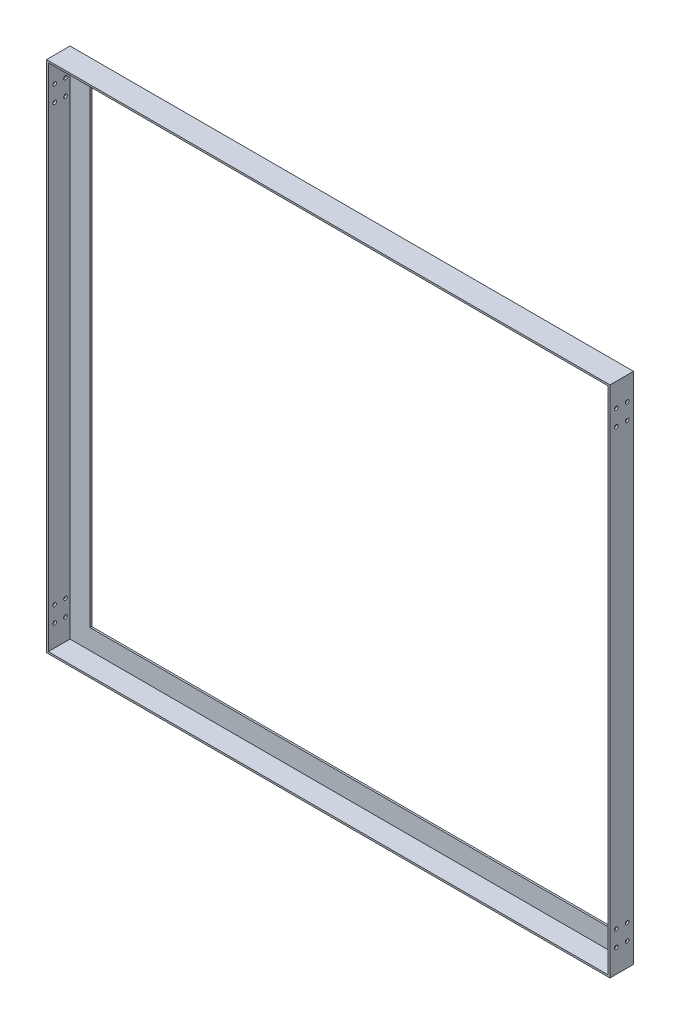
ISO-10303-21;
HEADER;
FILE_DESCRIPTION(('STEP AP214'),'2;1');
FILE_NAME('part.step','',(''),(''),'','','');
FILE_SCHEMA(('AUTOMOTIVE_DESIGN { 1 0 10303 214 1 1 1 1 }'));
ENDSEC;
DATA;
#1=APPLICATION_CONTEXT('core data for automotive mechanical design processes');
#2=APPLICATION_PROTOCOL_DEFINITION('international standard','automotive_design',2000,#1);
#3=PRODUCT_CONTEXT('',#1,'mechanical');
#4=PRODUCT('Part','Part','',(#3));
#5=PRODUCT_RELATED_PRODUCT_CATEGORY('part','',(#4));
#6=PRODUCT_DEFINITION_FORMATION('','',#4);
#7=PRODUCT_DEFINITION_CONTEXT('part definition',#1,'design');
#8=PRODUCT_DEFINITION('design','',#6,#7);
#9=PRODUCT_DEFINITION_SHAPE('','',#8);
#10=(LENGTH_UNIT() NAMED_UNIT(*) SI_UNIT(.MILLI.,.METRE.));
#11=(NAMED_UNIT(*) PLANE_ANGLE_UNIT() SI_UNIT($,.RADIAN.));
#12=(NAMED_UNIT(*) SI_UNIT($,.STERADIAN.) SOLID_ANGLE_UNIT());
#13=UNCERTAINTY_MEASURE_WITH_UNIT(LENGTH_MEASURE(1.E-05),#10,'distance_accuracy_value','');
#14=(GEOMETRIC_REPRESENTATION_CONTEXT(3) GLOBAL_UNCERTAINTY_ASSIGNED_CONTEXT((#13)) GLOBAL_UNIT_ASSIGNED_CONTEXT((#10,
#11,#12)) REPRESENTATION_CONTEXT('',''));
#15=CARTESIAN_POINT('',(0.,0.,0.));
#16=DIRECTION('',(0.,0.,1.));
#17=DIRECTION('',(1.,0.,0.));
#18=AXIS2_PLACEMENT_3D('',#15,#16,#17);
#19=CARTESIAN_POINT('',(0.,0.,3.1));
#20=DIRECTION('',(0.,0.,1.));
#21=DIRECTION('',(1.,0.,0.));
#22=AXIS2_PLACEMENT_3D('',#19,#20,#21);
#23=PLANE('',#22);
#24=DIRECTION('',(0.,-1.,0.));
#25=VECTOR('',#24,1.);
#26=CARTESIAN_POINT('',(-984.2,896.9,3.1));
#27=LINE('',#26,#25);
#28=CARTESIAN_POINT('',(-984.2,896.9,3.1));
#29=VERTEX_POINT('',#28);
#30=CARTESIAN_POINT('',(-984.2,3.1,3.1));
#31=VERTEX_POINT('',#30);
#32=EDGE_CURVE('E53',#29,#31,#27,.T.);
#33=ORIENTED_EDGE('',*,*,#32,.T.);
#34=DIRECTION('',(1.,0.,0.));
#35=VECTOR('',#34,1.);
#36=CARTESIAN_POINT('',(-984.2,3.1,3.1));
#37=LINE('',#36,#35);
#38=CARTESIAN_POINT('',(-3.09999999999988,3.1,3.1));
#39=VERTEX_POINT('',#38);
#40=EDGE_CURVE('E57',#31,#39,#37,.T.);
#41=ORIENTED_EDGE('',*,*,#40,.T.);
#42=DIRECTION('',(0.,1.,0.));
#43=VECTOR('',#42,1.);
#44=CARTESIAN_POINT('',(-3.09999999999999,896.9,3.1));
#45=LINE('',#44,#43);
#46=CARTESIAN_POINT('',(-3.09999999999999,896.9,3.1));
#47=VERTEX_POINT('',#46);
#48=EDGE_CURVE('E157',#39,#47,#45,.T.);
#49=ORIENTED_EDGE('',*,*,#48,.T.);
#50=DIRECTION('',(-1.,0.,0.));
#51=VECTOR('',#50,1.);
#52=CARTESIAN_POINT('',(-984.2,896.9,3.1));
#53=LINE('',#52,#51);
#54=EDGE_CURVE('E136',#47,#29,#53,.T.);
#55=ORIENTED_EDGE('',*,*,#54,.T.);
#56=EDGE_LOOP('',(#33,#41,#49,#55));
#57=FACE_BOUND('',#56,.T.);
#58=DIRECTION('',(-1.,0.,0.));
#59=VECTOR('',#58,1.);
#60=CARTESIAN_POINT('',(-38.1,861.9,3.1));
#61=LINE('',#60,#59);
#62=CARTESIAN_POINT('',(-38.1,861.9,3.1));
#63=VERTEX_POINT('',#62);
#64=CARTESIAN_POINT('',(-949.2,861.9,3.1));
#65=VERTEX_POINT('',#64);
#66=EDGE_CURVE('E179',#63,#65,#61,.T.);
#67=ORIENTED_EDGE('',*,*,#66,.F.);
#68=DIRECTION('',(0.,1.,0.));
#69=VECTOR('',#68,1.);
#70=CARTESIAN_POINT('',(-38.1,38.1,3.1));
#71=LINE('',#70,#69);
#72=CARTESIAN_POINT('',(-38.1,38.1,3.1));
#73=VERTEX_POINT('',#72);
#74=EDGE_CURVE('E177',#73,#63,#71,.T.);
#75=ORIENTED_EDGE('',*,*,#74,.F.);
#76=DIRECTION('',(1.,0.,0.));
#77=VECTOR('',#76,1.);
#78=CARTESIAN_POINT('',(-38.1,38.1,3.1));
#79=LINE('',#78,#77);
#80=CARTESIAN_POINT('',(-949.2,38.0999999999999,3.1));
#81=VERTEX_POINT('',#80);
#82=EDGE_CURVE('E185',#81,#73,#79,.T.);
#83=ORIENTED_EDGE('',*,*,#82,.F.);
#84=DIRECTION('',(0.,-1.,0.));
#85=VECTOR('',#84,1.);
#86=CARTESIAN_POINT('',(-949.2,38.0999999999999,3.1));
#87=LINE('',#86,#85);
#88=EDGE_CURVE('E182',#65,#81,#87,.T.);
#89=ORIENTED_EDGE('',*,*,#88,.F.);
#90=EDGE_LOOP('',(#67,#75,#83,#89));
#91=FACE_BOUND('',#90,.T.);
#92=ADVANCED_FACE('F36',(#57,#91),#23,.T.);
#93=CARTESIAN_POINT('',(0.,0.,0.));
#94=DIRECTION('',(0.,0.,1.));
#95=DIRECTION('',(1.,0.,0.));
#96=AXIS2_PLACEMENT_3D('',#93,#94,#95);
#97=PLANE('',#96);
#98=DIRECTION('',(0.,1.,0.));
#99=VECTOR('',#98,1.);
#100=CARTESIAN_POINT('',(0.,0.,0.));
#101=LINE('',#100,#99);
#102=CARTESIAN_POINT('',(0.,0.,0.));
#103=VERTEX_POINT('',#102);
#104=CARTESIAN_POINT('',(0.,900.,0.));
#105=VERTEX_POINT('',#104);
#106=EDGE_CURVE('E207',#103,#105,#101,.T.);
#107=ORIENTED_EDGE('',*,*,#106,.F.);
#108=DIRECTION('',(1.,0.,0.));
#109=VECTOR('',#108,1.);
#110=CARTESIAN_POINT('',(0.,0.,0.));
#111=LINE('',#110,#109);
#112=CARTESIAN_POINT('',(-987.3,-1.20909378479818E-13,0.));
#113=VERTEX_POINT('',#112);
#114=EDGE_CURVE('E214',#113,#103,#111,.T.);
#115=ORIENTED_EDGE('',*,*,#114,.F.);
#116=DIRECTION('',(0.,-1.,0.));
#117=VECTOR('',#116,1.);
#118=CARTESIAN_POINT('',(-987.3,-1.20909378479818E-13,0.));
#119=LINE('',#118,#117);
#120=CARTESIAN_POINT('',(-987.3,900.,0.));
#121=VERTEX_POINT('',#120);
#122=EDGE_CURVE('E212',#121,#113,#119,.T.);
#123=ORIENTED_EDGE('',*,*,#122,.F.);
#124=DIRECTION('',(-1.,0.,0.));
#125=VECTOR('',#124,1.);
#126=CARTESIAN_POINT('',(0.,900.,0.));
#127=LINE('',#126,#125);
#128=EDGE_CURVE('E210',#105,#121,#127,.T.);
#129=ORIENTED_EDGE('',*,*,#128,.F.);
#130=EDGE_LOOP('',(#107,#115,#123,#129));
#131=FACE_BOUND('',#130,.T.);
#132=DIRECTION('',(0.,1.,0.));
#133=VECTOR('',#132,1.);
#134=CARTESIAN_POINT('',(-38.1,38.1,0.));
#135=LINE('',#134,#133);
#136=CARTESIAN_POINT('',(-38.1,38.1,0.));
#137=VERTEX_POINT('',#136);
#138=CARTESIAN_POINT('',(-38.1,861.9,0.));
#139=VERTEX_POINT('',#138);
#140=EDGE_CURVE('E176',#137,#139,#135,.T.);
#141=ORIENTED_EDGE('',*,*,#140,.T.);
#142=DIRECTION('',(-1.,0.,0.));
#143=VECTOR('',#142,1.);
#144=CARTESIAN_POINT('',(-38.1,861.9,0.));
#145=LINE('',#144,#143);
#146=CARTESIAN_POINT('',(-949.2,861.9,0.));
#147=VERTEX_POINT('',#146);
#148=EDGE_CURVE('E190',#139,#147,#145,.T.);
#149=ORIENTED_EDGE('',*,*,#148,.T.);
#150=DIRECTION('',(0.,-1.,0.));
#151=VECTOR('',#150,1.);
#152=CARTESIAN_POINT('',(-949.2,38.0999999999999,0.));
#153=LINE('',#152,#151);
#154=CARTESIAN_POINT('',(-949.2,38.0999999999999,0.));
#155=VERTEX_POINT('',#154);
#156=EDGE_CURVE('E193',#147,#155,#153,.T.);
#157=ORIENTED_EDGE('',*,*,#156,.T.);
#158=DIRECTION('',(1.,0.,0.));
#159=VECTOR('',#158,1.);
#160=CARTESIAN_POINT('',(-38.1,38.1,0.));
#161=LINE('',#160,#159);
#162=EDGE_CURVE('E180',#155,#137,#161,.T.);
#163=ORIENTED_EDGE('',*,*,#162,.T.);
#164=EDGE_LOOP('',(#141,#149,#157,#163));
#165=FACE_BOUND('',#164,.T.);
#166=ADVANCED_FACE('F302',(#131,#165),#97,.F.);
#167=CARTESIAN_POINT('',(0.,0.,3.1));
#168=DIRECTION('',(-1.,0.,0.));
#169=DIRECTION('',(0.,0.,1.));
#170=AXIS2_PLACEMENT_3D('',#167,#168,#169);
#171=PLANE('',#170);
#172=CARTESIAN_POINT('',(0.,68.9999999999999,30.125));
#173=DIRECTION('',(-1.,0.,0.));
#174=DIRECTION('',(0.,0.,1.));
#175=AXIS2_PLACEMENT_3D('',#172,#173,#174);
#176=CIRCLE('',#175,3.17500000000004);
#177=CARTESIAN_POINT('',(0.,68.9999999999999,33.3));
#178=VERTEX_POINT('',#177);
#179=EDGE_CURVE('E155',#178,#178,#176,.T.);
#180=ORIENTED_EDGE('',*,*,#179,.T.);
#181=EDGE_LOOP('',(#180));
#182=FACE_BOUND('',#181,.T.);
#183=CARTESIAN_POINT('',(0.,831.,30.125));
#184=DIRECTION('',(-1.,0.,0.));
#185=DIRECTION('',(0.,0.,1.));
#186=AXIS2_PLACEMENT_3D('',#183,#184,#185);
#187=CIRCLE('',#186,3.175);
#188=CARTESIAN_POINT('',(0.,831.,33.3));
#189=VERTEX_POINT('',#188);
#190=EDGE_CURVE('E260',#189,#189,#187,.T.);
#191=ORIENTED_EDGE('',*,*,#190,.T.);
#192=EDGE_LOOP('',(#191));
#193=FACE_BOUND('',#192,.T.);
#194=CARTESIAN_POINT('',(0.,859.,30.125));
#195=DIRECTION('',(-1.,0.,0.));
#196=DIRECTION('',(0.,0.,1.));
#197=AXIS2_PLACEMENT_3D('',#194,#195,#196);
#198=CIRCLE('',#197,3.17500000000006);
#199=CARTESIAN_POINT('',(0.,859.,33.3000000000001));
#200=VERTEX_POINT('',#199);
#201=EDGE_CURVE('E256',#200,#200,#198,.T.);
#202=ORIENTED_EDGE('',*,*,#201,.T.);
#203=EDGE_LOOP('',(#202));
#204=FACE_BOUND('',#203,.T.);
#205=CARTESIAN_POINT('',(0.,831.,11.075));
#206=DIRECTION('',(-1.,0.,0.));
#207=DIRECTION('',(0.,0.,1.));
#208=AXIS2_PLACEMENT_3D('',#205,#206,#207);
#209=CIRCLE('',#208,3.175);
#210=CARTESIAN_POINT('',(0.,831.,14.25));
#211=VERTEX_POINT('',#210);
#212=EDGE_CURVE('E252',#211,#211,#209,.T.);
#213=ORIENTED_EDGE('',*,*,#212,.T.);
#214=EDGE_LOOP('',(#213));
#215=FACE_BOUND('',#214,.T.);
#216=CARTESIAN_POINT('',(0.,68.9999999999998,11.075));
#217=DIRECTION('',(-1.,0.,0.));
#218=DIRECTION('',(0.,0.,1.));
#219=AXIS2_PLACEMENT_3D('',#216,#217,#218);
#220=CIRCLE('',#219,3.17500000000002);
#221=CARTESIAN_POINT('',(0.,68.9999999999998,14.25));
#222=VERTEX_POINT('',#221);
#223=EDGE_CURVE('E248',#222,#222,#220,.T.);
#224=ORIENTED_EDGE('',*,*,#223,.T.);
#225=EDGE_LOOP('',(#224));
#226=FACE_BOUND('',#225,.T.);
#227=CARTESIAN_POINT('',(0.,40.9999999999998,11.075));
#228=DIRECTION('',(-1.,0.,0.));
#229=DIRECTION('',(0.,0.,1.));
#230=AXIS2_PLACEMENT_3D('',#227,#228,#229);
#231=CIRCLE('',#230,3.17500000000004);
#232=CARTESIAN_POINT('',(0.,40.9999999999998,14.25));
#233=VERTEX_POINT('',#232);
#234=EDGE_CURVE('E243',#233,#233,#231,.T.);
#235=ORIENTED_EDGE('',*,*,#234,.T.);
#236=EDGE_LOOP('',(#235));
#237=FACE_BOUND('',#236,.T.);
#238=CARTESIAN_POINT('',(0.,40.9999999999998,30.125));
#239=DIRECTION('',(-1.,0.,0.));
#240=DIRECTION('',(0.,0.,1.));
#241=AXIS2_PLACEMENT_3D('',#238,#239,#240);
#242=CIRCLE('',#241,3.17500000000007);
#243=CARTESIAN_POINT('',(0.,40.9999999999998,33.3000000000001));
#244=VERTEX_POINT('',#243);
#245=EDGE_CURVE('E238',#244,#244,#242,.T.);
#246=ORIENTED_EDGE('',*,*,#245,.T.);
#247=EDGE_LOOP('',(#246));
#248=FACE_BOUND('',#247,.T.);
#249=CARTESIAN_POINT('',(0.,859.,11.075));
#250=DIRECTION('',(-1.,0.,0.));
#251=DIRECTION('',(0.,0.,1.));
#252=AXIS2_PLACEMENT_3D('',#249,#250,#251);
#253=CIRCLE('',#252,3.17500000000007);
#254=CARTESIAN_POINT('',(0.,859.,14.2500000000001));
#255=VERTEX_POINT('',#254);
#256=EDGE_CURVE('E233',#255,#255,#253,.T.);
#257=ORIENTED_EDGE('',*,*,#256,.T.);
#258=EDGE_LOOP('',(#257));
#259=FACE_BOUND('',#258,.T.);
#260=ORIENTED_EDGE('',*,*,#106,.T.);
#261=DIRECTION('',(0.,0.,-1.));
#262=VECTOR('',#261,1.);
#263=CARTESIAN_POINT('',(0.,900.,3.1));
#264=LINE('',#263,#262);
#265=CARTESIAN_POINT('',(0.,900.,41.2));
#266=VERTEX_POINT('',#265);
#267=EDGE_CURVE('E11',#266,#105,#264,.T.);
#268=ORIENTED_EDGE('',*,*,#267,.F.);
#269=DIRECTION('',(0.,1.,0.));
#270=VECTOR('',#269,1.);
#271=CARTESIAN_POINT('',(0.,900.,41.2));
#272=LINE('',#271,#270);
#273=CARTESIAN_POINT('',(0.,0.,41.2));
#274=VERTEX_POINT('',#273);
#275=EDGE_CURVE('E170',#274,#266,#272,.T.);
#276=ORIENTED_EDGE('',*,*,#275,.F.);
#277=DIRECTION('',(0.,0.,-1.));
#278=VECTOR('',#277,1.);
#279=CARTESIAN_POINT('',(0.,0.,3.1));
#280=LINE('',#279,#278);
#281=EDGE_CURVE('E216',#274,#103,#280,.T.);
#282=ORIENTED_EDGE('',*,*,#281,.T.);
#283=EDGE_LOOP('',(#260,#268,#276,#282));
#284=FACE_BOUND('',#283,.T.);
#285=ADVANCED_FACE('F38',(#182,#193,#204,#215,#226,#237,#248,#259,#284),#171,.F.);
#286=CARTESIAN_POINT('',(0.,900.,3.1));
#287=DIRECTION('',(0.,-1.,0.));
#288=DIRECTION('',(1.,0.,0.));
#289=AXIS2_PLACEMENT_3D('',#286,#287,#288);
#290=PLANE('',#289);
#291=ORIENTED_EDGE('',*,*,#128,.T.);
#292=DIRECTION('',(0.,0.,-1.));
#293=VECTOR('',#292,1.);
#294=CARTESIAN_POINT('',(-987.3,900.,3.1));
#295=LINE('',#294,#293);
#296=CARTESIAN_POINT('',(-987.3,900.,41.2));
#297=VERTEX_POINT('',#296);
#298=EDGE_CURVE('E45',#297,#121,#295,.T.);
#299=ORIENTED_EDGE('',*,*,#298,.F.);
#300=DIRECTION('',(-1.,0.,0.));
#301=VECTOR('',#300,1.);
#302=CARTESIAN_POINT('',(-987.3,900.,41.2));
#303=LINE('',#302,#301);
#304=EDGE_CURVE('E173',#266,#297,#303,.T.);
#305=ORIENTED_EDGE('',*,*,#304,.F.);
#306=ORIENTED_EDGE('',*,*,#267,.T.);
#307=EDGE_LOOP('',(#291,#299,#305,#306));
#308=FACE_BOUND('',#307,.T.);
#309=ADVANCED_FACE('F320',(#308),#290,.F.);
#310=CARTESIAN_POINT('',(-987.3,-1.20909378479818E-13,3.1));
#311=DIRECTION('',(1.,0.,0.));
#312=DIRECTION('',(0.,0.,-1.));
#313=AXIS2_PLACEMENT_3D('',#310,#311,#312);
#314=PLANE('',#313);
#315=CARTESIAN_POINT('',(-987.3,68.9999999999999,30.125));
#316=DIRECTION('',(-1.,0.,0.));
#317=DIRECTION('',(0.,0.,1.));
#318=AXIS2_PLACEMENT_3D('',#315,#316,#317);
#319=CIRCLE('',#318,3.17500000000004);
#320=CARTESIAN_POINT('',(-987.3,68.9999999999999,33.3));
#321=VERTEX_POINT('',#320);
#322=EDGE_CURVE('E550',#321,#321,#319,.T.);
#323=ORIENTED_EDGE('',*,*,#322,.F.);
#324=EDGE_LOOP('',(#323));
#325=FACE_BOUND('',#324,.T.);
#326=CARTESIAN_POINT('',(-987.3,831.,30.125));
#327=DIRECTION('',(-1.,0.,0.));
#328=DIRECTION('',(0.,0.,-1.));
#329=AXIS2_PLACEMENT_3D('',#326,#327,#328);
#330=CIRCLE('',#329,3.175);
#331=CARTESIAN_POINT('',(-987.3,831.,26.95));
#332=VERTEX_POINT('',#331);
#333=EDGE_CURVE('E547',#332,#332,#330,.T.);
#334=ORIENTED_EDGE('',*,*,#333,.F.);
#335=EDGE_LOOP('',(#334));
#336=FACE_BOUND('',#335,.T.);
#337=CARTESIAN_POINT('',(-987.3,859.,30.125));
#338=DIRECTION('',(-1.,0.,0.));
#339=DIRECTION('',(0.,0.,-1.));
#340=AXIS2_PLACEMENT_3D('',#337,#338,#339);
#341=CIRCLE('',#340,3.17500000000006);
#342=CARTESIAN_POINT('',(-987.3,859.,26.9499999999999));
#343=VERTEX_POINT('',#342);
#344=EDGE_CURVE('E549',#343,#343,#341,.T.);
#345=ORIENTED_EDGE('',*,*,#344,.F.);
#346=EDGE_LOOP('',(#345));
#347=FACE_BOUND('',#346,.T.);
#348=CARTESIAN_POINT('',(-987.3,831.,11.075));
#349=DIRECTION('',(-1.,0.,0.));
#350=DIRECTION('',(0.,0.,1.));
#351=AXIS2_PLACEMENT_3D('',#348,#349,#350);
#352=CIRCLE('',#351,3.175);
#353=CARTESIAN_POINT('',(-987.3,831.,14.25));
#354=VERTEX_POINT('',#353);
#355=EDGE_CURVE('E553',#354,#354,#352,.T.);
#356=ORIENTED_EDGE('',*,*,#355,.F.);
#357=EDGE_LOOP('',(#356));
#358=FACE_BOUND('',#357,.T.);
#359=CARTESIAN_POINT('',(-987.3,68.9999999999998,11.075));
#360=DIRECTION('',(-1.,0.,0.));
#361=DIRECTION('',(0.,0.,-1.));
#362=AXIS2_PLACEMENT_3D('',#359,#360,#361);
#363=CIRCLE('',#362,3.17500000000002);
#364=CARTESIAN_POINT('',(-987.3,68.9999999999998,7.89999999999998));
#365=VERTEX_POINT('',#364);
#366=EDGE_CURVE('E556',#365,#365,#363,.T.);
#367=ORIENTED_EDGE('',*,*,#366,.F.);
#368=EDGE_LOOP('',(#367));
#369=FACE_BOUND('',#368,.T.);
#370=CARTESIAN_POINT('',(-987.3,40.9999999999998,11.075));
#371=DIRECTION('',(-1.,0.,0.));
#372=DIRECTION('',(0.,0.,-1.));
#373=AXIS2_PLACEMENT_3D('',#370,#371,#372);
#374=CIRCLE('',#373,3.17500000000004);
#375=CARTESIAN_POINT('',(-987.3,40.9999999999998,7.89999999999997));
#376=VERTEX_POINT('',#375);
#377=EDGE_CURVE('E617',#376,#376,#374,.T.);
#378=ORIENTED_EDGE('',*,*,#377,.F.);
#379=EDGE_LOOP('',(#378));
#380=FACE_BOUND('',#379,.T.);
#381=CARTESIAN_POINT('',(-987.3,40.9999999999998,30.125));
#382=DIRECTION('',(-1.,0.,0.));
#383=DIRECTION('',(0.,0.,1.));
#384=AXIS2_PLACEMENT_3D('',#381,#382,#383);
#385=CIRCLE('',#384,3.17500000000007);
#386=CARTESIAN_POINT('',(-987.3,40.9999999999998,33.3000000000001));
#387=VERTEX_POINT('',#386);
#388=EDGE_CURVE('E559',#387,#387,#385,.T.);
#389=ORIENTED_EDGE('',*,*,#388,.F.);
#390=EDGE_LOOP('',(#389));
#391=FACE_BOUND('',#390,.T.);
#392=CARTESIAN_POINT('',(-987.3,859.,11.075));
#393=DIRECTION('',(-1.,0.,0.));
#394=DIRECTION('',(0.,0.,1.));
#395=AXIS2_PLACEMENT_3D('',#392,#393,#394);
#396=CIRCLE('',#395,3.17500000000007);
#397=CARTESIAN_POINT('',(-987.3,859.,14.2500000000001));
#398=VERTEX_POINT('',#397);
#399=EDGE_CURVE('E228',#398,#398,#396,.T.);
#400=ORIENTED_EDGE('',*,*,#399,.F.);
#401=EDGE_LOOP('',(#400));
#402=FACE_BOUND('',#401,.T.);
#403=ORIENTED_EDGE('',*,*,#122,.T.);
#404=DIRECTION('',(0.,0.,-1.));
#405=VECTOR('',#404,1.);
#406=CARTESIAN_POINT('',(-987.3,-1.20909378479818E-13,3.1));
#407=LINE('',#406,#405);
#408=CARTESIAN_POINT('',(-987.3,0.,41.2));
#409=VERTEX_POINT('',#408);
#410=EDGE_CURVE('E219',#409,#113,#407,.T.);
#411=ORIENTED_EDGE('',*,*,#410,.F.);
#412=DIRECTION('',(0.,-1.,0.));
#413=VECTOR('',#412,1.);
#414=CARTESIAN_POINT('',(-987.3,900.,41.2));
#415=LINE('',#414,#413);
#416=EDGE_CURVE('E141',#297,#409,#415,.T.);
#417=ORIENTED_EDGE('',*,*,#416,.F.);
#418=ORIENTED_EDGE('',*,*,#298,.T.);
#419=EDGE_LOOP('',(#403,#411,#417,#418));
#420=FACE_BOUND('',#419,.T.);
#421=ADVANCED_FACE('F317',(#325,#336,#347,#358,#369,#380,#391,#402,#420),#314,.F.);
#422=CARTESIAN_POINT('',(0.,0.,3.1));
#423=DIRECTION('',(0.,1.,0.));
#424=DIRECTION('',(-1.,0.,0.));
#425=AXIS2_PLACEMENT_3D('',#422,#423,#424);
#426=PLANE('',#425);
#427=ORIENTED_EDGE('',*,*,#114,.T.);
#428=ORIENTED_EDGE('',*,*,#281,.F.);
#429=DIRECTION('',(1.,0.,0.));
#430=VECTOR('',#429,1.);
#431=CARTESIAN_POINT('',(-987.3,0.,41.2));
#432=LINE('',#431,#430);
#433=EDGE_CURVE('E167',#409,#274,#432,.T.);
#434=ORIENTED_EDGE('',*,*,#433,.F.);
#435=ORIENTED_EDGE('',*,*,#410,.T.);
#436=EDGE_LOOP('',(#427,#428,#434,#435));
#437=FACE_BOUND('',#436,.T.);
#438=ADVANCED_FACE('F314',(#437),#426,.F.);
#439=CARTESIAN_POINT('',(-38.1,38.1,3.1));
#440=DIRECTION('',(-1.,0.,0.));
#441=DIRECTION('',(0.,0.,1.));
#442=AXIS2_PLACEMENT_3D('',#439,#440,#441);
#443=PLANE('',#442);
#444=ORIENTED_EDGE('',*,*,#140,.F.);
#445=DIRECTION('',(0.,0.,-1.));
#446=VECTOR('',#445,1.);
#447=CARTESIAN_POINT('',(-38.1,38.1,3.1));
#448=LINE('',#447,#446);
#449=EDGE_CURVE('E187',#73,#137,#448,.T.);
#450=ORIENTED_EDGE('',*,*,#449,.F.);
#451=ORIENTED_EDGE('',*,*,#74,.T.);
#452=DIRECTION('',(0.,0.,-1.));
#453=VECTOR('',#452,1.);
#454=CARTESIAN_POINT('',(-38.1,861.9,3.1));
#455=LINE('',#454,#453);
#456=EDGE_CURVE('E204',#63,#139,#455,.T.);
#457=ORIENTED_EDGE('',*,*,#456,.T.);
#458=EDGE_LOOP('',(#444,#450,#451,#457));
#459=FACE_BOUND('',#458,.T.);
#460=ADVANCED_FACE('F311',(#459),#443,.T.);
#461=CARTESIAN_POINT('',(-38.1,861.9,3.1));
#462=DIRECTION('',(0.,-1.,0.));
#463=DIRECTION('',(1.,0.,0.));
#464=AXIS2_PLACEMENT_3D('',#461,#462,#463);
#465=PLANE('',#464);
#466=ORIENTED_EDGE('',*,*,#148,.F.);
#467=ORIENTED_EDGE('',*,*,#456,.F.);
#468=ORIENTED_EDGE('',*,*,#66,.T.);
#469=DIRECTION('',(0.,0.,-1.));
#470=VECTOR('',#469,1.);
#471=CARTESIAN_POINT('',(-949.2,861.9,3.1));
#472=LINE('',#471,#470);
#473=EDGE_CURVE('E202',#65,#147,#472,.T.);
#474=ORIENTED_EDGE('',*,*,#473,.T.);
#475=EDGE_LOOP('',(#466,#467,#468,#474));
#476=FACE_BOUND('',#475,.T.);
#477=ADVANCED_FACE('F353',(#476),#465,.T.);
#478=CARTESIAN_POINT('',(-949.2,38.0999999999999,3.1));
#479=DIRECTION('',(1.,0.,0.));
#480=DIRECTION('',(0.,0.,-1.));
#481=AXIS2_PLACEMENT_3D('',#478,#479,#480);
#482=PLANE('',#481);
#483=ORIENTED_EDGE('',*,*,#156,.F.);
#484=ORIENTED_EDGE('',*,*,#473,.F.);
#485=ORIENTED_EDGE('',*,*,#88,.T.);
#486=DIRECTION('',(0.,0.,-1.));
#487=VECTOR('',#486,1.);
#488=CARTESIAN_POINT('',(-949.2,38.0999999999999,3.1));
#489=LINE('',#488,#487);
#490=EDGE_CURVE('E200',#81,#155,#489,.T.);
#491=ORIENTED_EDGE('',*,*,#490,.T.);
#492=EDGE_LOOP('',(#483,#484,#485,#491));
#493=FACE_BOUND('',#492,.T.);
#494=ADVANCED_FACE('F347',(#493),#482,.T.);
#495=CARTESIAN_POINT('',(-38.1,38.1,3.1));
#496=DIRECTION('',(0.,1.,0.));
#497=DIRECTION('',(-1.,0.,0.));
#498=AXIS2_PLACEMENT_3D('',#495,#496,#497);
#499=PLANE('',#498);
#500=ORIENTED_EDGE('',*,*,#162,.F.);
#501=ORIENTED_EDGE('',*,*,#490,.F.);
#502=ORIENTED_EDGE('',*,*,#82,.T.);
#503=ORIENTED_EDGE('',*,*,#449,.T.);
#504=EDGE_LOOP('',(#500,#501,#502,#503));
#505=FACE_BOUND('',#504,.T.);
#506=ADVANCED_FACE('F339',(#505),#499,.T.);
#507=CARTESIAN_POINT('',(0.,0.,41.2));
#508=DIRECTION('',(0.,0.,1.));
#509=DIRECTION('',(1.,0.,0.));
#510=AXIS2_PLACEMENT_3D('',#507,#508,#509);
#511=PLANE('',#510);
#512=ORIENTED_EDGE('',*,*,#416,.T.);
#513=ORIENTED_EDGE('',*,*,#433,.T.);
#514=ORIENTED_EDGE('',*,*,#275,.T.);
#515=ORIENTED_EDGE('',*,*,#304,.T.);
#516=EDGE_LOOP('',(#512,#513,#514,#515));
#517=FACE_BOUND('',#516,.T.);
#518=DIRECTION('',(1.,0.,0.));
#519=VECTOR('',#518,1.);
#520=CARTESIAN_POINT('',(-984.2,3.1,41.2));
#521=LINE('',#520,#519);
#522=CARTESIAN_POINT('',(-984.2,3.1,41.2));
#523=VERTEX_POINT('',#522);
#524=CARTESIAN_POINT('',(-3.09999999999988,3.1,41.2));
#525=VERTEX_POINT('',#524);
#526=EDGE_CURVE('E135',#523,#525,#521,.T.);
#527=ORIENTED_EDGE('',*,*,#526,.F.);
#528=DIRECTION('',(0.,-1.,0.));
#529=VECTOR('',#528,1.);
#530=CARTESIAN_POINT('',(-984.2,896.9,41.2));
#531=LINE('',#530,#529);
#532=CARTESIAN_POINT('',(-984.2,896.9,41.2));
#533=VERTEX_POINT('',#532);
#534=EDGE_CURVE('E126',#533,#523,#531,.T.);
#535=ORIENTED_EDGE('',*,*,#534,.F.);
#536=DIRECTION('',(-1.,0.,0.));
#537=VECTOR('',#536,1.);
#538=CARTESIAN_POINT('',(-984.2,896.9,41.2));
#539=LINE('',#538,#537);
#540=CARTESIAN_POINT('',(-3.09999999999999,896.9,41.2));
#541=VERTEX_POINT('',#540);
#542=EDGE_CURVE('E149',#541,#533,#539,.T.);
#543=ORIENTED_EDGE('',*,*,#542,.F.);
#544=DIRECTION('',(0.,1.,0.));
#545=VECTOR('',#544,1.);
#546=CARTESIAN_POINT('',(-3.09999999999999,896.9,41.2));
#547=LINE('',#546,#545);
#548=EDGE_CURVE('E147',#525,#541,#547,.T.);
#549=ORIENTED_EDGE('',*,*,#548,.F.);
#550=EDGE_LOOP('',(#527,#535,#543,#549));
#551=FACE_BOUND('',#550,.T.);
#552=ADVANCED_FACE('F145',(#517,#551),#511,.T.);
#553=CARTESIAN_POINT('',(-984.2,896.9,41.2));
#554=DIRECTION('',(1.,0.,0.));
#555=DIRECTION('',(0.,1.,0.));
#556=AXIS2_PLACEMENT_3D('',#553,#554,#555);
#557=PLANE('',#556);
#558=CARTESIAN_POINT('',(-984.2,68.9999999999999,30.125));
#559=DIRECTION('',(1.,0.,0.));
#560=DIRECTION('',(0.,1.,0.));
#561=AXIS2_PLACEMENT_3D('',#558,#559,#560);
#562=CIRCLE('',#561,3.17500000000004);
#563=CARTESIAN_POINT('',(-984.2,72.1749999999999,30.125));
#564=VERTEX_POINT('',#563);
#565=EDGE_CURVE('E272',#564,#564,#562,.T.);
#566=ORIENTED_EDGE('',*,*,#565,.F.);
#567=EDGE_LOOP('',(#566));
#568=FACE_BOUND('',#567,.T.);
#569=CARTESIAN_POINT('',(-984.2,831.,30.125));
#570=DIRECTION('',(1.,0.,0.));
#571=DIRECTION('',(0.,1.,0.));
#572=AXIS2_PLACEMENT_3D('',#569,#570,#571);
#573=CIRCLE('',#572,3.175);
#574=CARTESIAN_POINT('',(-984.2,834.175,30.125));
#575=VERTEX_POINT('',#574);
#576=EDGE_CURVE('E255',#575,#575,#573,.T.);
#577=ORIENTED_EDGE('',*,*,#576,.F.);
#578=EDGE_LOOP('',(#577));
#579=FACE_BOUND('',#578,.T.);
#580=CARTESIAN_POINT('',(-984.2,859.,30.125));
#581=DIRECTION('',(1.,0.,0.));
#582=DIRECTION('',(0.,1.,0.));
#583=AXIS2_PLACEMENT_3D('',#580,#581,#582);
#584=CIRCLE('',#583,3.17500000000006);
#585=CARTESIAN_POINT('',(-984.2,862.175,30.125));
#586=VERTEX_POINT('',#585);
#587=EDGE_CURVE('E251',#586,#586,#584,.T.);
#588=ORIENTED_EDGE('',*,*,#587,.F.);
#589=EDGE_LOOP('',(#588));
#590=FACE_BOUND('',#589,.T.);
#591=CARTESIAN_POINT('',(-984.2,831.,11.075));
#592=DIRECTION('',(1.,0.,0.));
#593=DIRECTION('',(0.,1.,0.));
#594=AXIS2_PLACEMENT_3D('',#591,#592,#593);
#595=CIRCLE('',#594,3.175);
#596=CARTESIAN_POINT('',(-984.2,834.175,11.075));
#597=VERTEX_POINT('',#596);
#598=EDGE_CURVE('E247',#597,#597,#595,.T.);
#599=ORIENTED_EDGE('',*,*,#598,.F.);
#600=EDGE_LOOP('',(#599));
#601=FACE_BOUND('',#600,.T.);
#602=CARTESIAN_POINT('',(-984.2,68.9999999999998,11.075));
#603=DIRECTION('',(1.,0.,0.));
#604=DIRECTION('',(0.,1.,0.));
#605=AXIS2_PLACEMENT_3D('',#602,#603,#604);
#606=CIRCLE('',#605,3.17500000000002);
#607=CARTESIAN_POINT('',(-984.2,72.1749999999999,11.075));
#608=VERTEX_POINT('',#607);
#609=EDGE_CURVE('E242',#608,#608,#606,.T.);
#610=ORIENTED_EDGE('',*,*,#609,.F.);
#611=EDGE_LOOP('',(#610));
#612=FACE_BOUND('',#611,.T.);
#613=CARTESIAN_POINT('',(-984.2,40.9999999999998,11.075));
#614=DIRECTION('',(1.,0.,0.));
#615=DIRECTION('',(0.,1.,0.));
#616=AXIS2_PLACEMENT_3D('',#613,#614,#615);
#617=CIRCLE('',#616,3.17500000000004);
#618=CARTESIAN_POINT('',(-984.2,44.1749999999999,11.075));
#619=VERTEX_POINT('',#618);
#620=EDGE_CURVE('E237',#619,#619,#617,.T.);
#621=ORIENTED_EDGE('',*,*,#620,.F.);
#622=EDGE_LOOP('',(#621));
#623=FACE_BOUND('',#622,.T.);
#624=CARTESIAN_POINT('',(-984.2,40.9999999999998,30.125));
#625=DIRECTION('',(1.,0.,0.));
#626=DIRECTION('',(0.,1.,0.));
#627=AXIS2_PLACEMENT_3D('',#624,#625,#626);
#628=CIRCLE('',#627,3.17500000000007);
#629=CARTESIAN_POINT('',(-984.2,44.1749999999999,30.125));
#630=VERTEX_POINT('',#629);
#631=EDGE_CURVE('E232',#630,#630,#628,.T.);
#632=ORIENTED_EDGE('',*,*,#631,.F.);
#633=EDGE_LOOP('',(#632));
#634=FACE_BOUND('',#633,.T.);
#635=CARTESIAN_POINT('',(-984.2,859.,11.075));
#636=DIRECTION('',(1.,0.,0.));
#637=DIRECTION('',(0.,1.,0.));
#638=AXIS2_PLACEMENT_3D('',#635,#636,#637);
#639=CIRCLE('',#638,3.17500000000007);
#640=CARTESIAN_POINT('',(-984.2,862.175,11.075));
#641=VERTEX_POINT('',#640);
#642=EDGE_CURVE('E227',#641,#641,#639,.T.);
#643=ORIENTED_EDGE('',*,*,#642,.F.);
#644=EDGE_LOOP('',(#643));
#645=FACE_BOUND('',#644,.T.);
#646=ORIENTED_EDGE('',*,*,#32,.F.);
#647=DIRECTION('',(0.,0.,-1.));
#648=VECTOR('',#647,1.);
#649=CARTESIAN_POINT('',(-984.2,896.9,41.2));
#650=LINE('',#649,#648);
#651=EDGE_CURVE('E131',#533,#29,#650,.T.);
#652=ORIENTED_EDGE('',*,*,#651,.F.);
#653=ORIENTED_EDGE('',*,*,#534,.T.);
#654=DIRECTION('',(0.,0.,-1.));
#655=VECTOR('',#654,1.);
#656=CARTESIAN_POINT('',(-984.2,3.1,41.2));
#657=LINE('',#656,#655);
#658=EDGE_CURVE('E129',#523,#31,#657,.T.);
#659=ORIENTED_EDGE('',*,*,#658,.T.);
#660=EDGE_LOOP('',(#646,#652,#653,#659));
#661=FACE_BOUND('',#660,.T.);
#662=ADVANCED_FACE('F128',(#568,#579,#590,#601,#612,#623,#634,#645,#661),#557,.T.);
#663=CARTESIAN_POINT('',(-984.2,3.1,41.2));
#664=DIRECTION('',(0.,1.,0.));
#665=DIRECTION('',(0.,0.,1.));
#666=AXIS2_PLACEMENT_3D('',#663,#664,#665);
#667=PLANE('',#666);
#668=ORIENTED_EDGE('',*,*,#40,.F.);
#669=ORIENTED_EDGE('',*,*,#658,.F.);
#670=ORIENTED_EDGE('',*,*,#526,.T.);
#671=DIRECTION('',(0.,0.,-1.));
#672=VECTOR('',#671,1.);
#673=CARTESIAN_POINT('',(-3.09999999999988,3.1,41.2));
#674=LINE('',#673,#672);
#675=EDGE_CURVE('E142',#525,#39,#674,.T.);
#676=ORIENTED_EDGE('',*,*,#675,.T.);
#677=EDGE_LOOP('',(#668,#669,#670,#676));
#678=FACE_BOUND('',#677,.T.);
#679=ADVANCED_FACE('F139',(#678),#667,.T.);
#680=CARTESIAN_POINT('',(-3.09999999999999,896.9,41.2));
#681=DIRECTION('',(-1.,0.,0.));
#682=DIRECTION('',(0.,-1.,0.));
#683=AXIS2_PLACEMENT_3D('',#680,#681,#682);
#684=PLANE('',#683);
#685=CARTESIAN_POINT('',(-3.09999999999989,68.9999999999999,30.125));
#686=DIRECTION('',(-1.,0.,0.));
#687=DIRECTION('',(0.,-1.,0.));
#688=AXIS2_PLACEMENT_3D('',#685,#686,#687);
#689=CIRCLE('',#688,3.17500000000004);
#690=CARTESIAN_POINT('',(-3.09999999999989,65.8249999999999,30.125));
#691=VERTEX_POINT('',#690);
#692=EDGE_CURVE('E40',#691,#691,#689,.T.);
#693=ORIENTED_EDGE('',*,*,#692,.F.);
#694=EDGE_LOOP('',(#693));
#695=FACE_BOUND('',#694,.T.);
#696=CARTESIAN_POINT('',(-3.09999999999999,831.,30.125));
#697=DIRECTION('',(-1.,0.,0.));
#698=DIRECTION('',(0.,-1.,0.));
#699=AXIS2_PLACEMENT_3D('',#696,#697,#698);
#700=CIRCLE('',#699,3.175);
#701=CARTESIAN_POINT('',(-3.09999999999999,827.825,30.125));
#702=VERTEX_POINT('',#701);
#703=EDGE_CURVE('E253',#702,#702,#700,.T.);
#704=ORIENTED_EDGE('',*,*,#703,.F.);
#705=EDGE_LOOP('',(#704));
#706=FACE_BOUND('',#705,.T.);
#707=CARTESIAN_POINT('',(-3.09999999999999,859.,30.125));
#708=DIRECTION('',(-1.,0.,0.));
#709=DIRECTION('',(0.,-1.,0.));
#710=AXIS2_PLACEMENT_3D('',#707,#708,#709);
#711=CIRCLE('',#710,3.17500000000006);
#712=CARTESIAN_POINT('',(-3.09999999999999,855.825,30.125));
#713=VERTEX_POINT('',#712);
#714=EDGE_CURVE('E249',#713,#713,#711,.T.);
#715=ORIENTED_EDGE('',*,*,#714,.F.);
#716=EDGE_LOOP('',(#715));
#717=FACE_BOUND('',#716,.T.);
#718=CARTESIAN_POINT('',(-3.09999999999999,831.,11.075));
#719=DIRECTION('',(-1.,0.,0.));
#720=DIRECTION('',(0.,-1.,0.));
#721=AXIS2_PLACEMENT_3D('',#718,#719,#720);
#722=CIRCLE('',#721,3.175);
#723=CARTESIAN_POINT('',(-3.09999999999999,827.825,11.075));
#724=VERTEX_POINT('',#723);
#725=EDGE_CURVE('E244',#724,#724,#722,.T.);
#726=ORIENTED_EDGE('',*,*,#725,.F.);
#727=EDGE_LOOP('',(#726));
#728=FACE_BOUND('',#727,.T.);
#729=CARTESIAN_POINT('',(-3.09999999999989,68.9999999999998,11.075));
#730=DIRECTION('',(-1.,0.,0.));
#731=DIRECTION('',(0.,-1.,0.));
#732=AXIS2_PLACEMENT_3D('',#729,#730,#731);
#733=CIRCLE('',#732,3.17500000000002);
#734=CARTESIAN_POINT('',(-3.09999999999989,65.8249999999998,11.075));
#735=VERTEX_POINT('',#734);
#736=EDGE_CURVE('E239',#735,#735,#733,.T.);
#737=ORIENTED_EDGE('',*,*,#736,.F.);
#738=EDGE_LOOP('',(#737));
#739=FACE_BOUND('',#738,.T.);
#740=CARTESIAN_POINT('',(-3.09999999999989,40.9999999999998,11.075));
#741=DIRECTION('',(-1.,0.,0.));
#742=DIRECTION('',(0.,-1.,0.));
#743=AXIS2_PLACEMENT_3D('',#740,#741,#742);
#744=CIRCLE('',#743,3.17500000000004);
#745=CARTESIAN_POINT('',(-3.09999999999989,37.8249999999998,11.075));
#746=VERTEX_POINT('',#745);
#747=EDGE_CURVE('E234',#746,#746,#744,.T.);
#748=ORIENTED_EDGE('',*,*,#747,.F.);
#749=EDGE_LOOP('',(#748));
#750=FACE_BOUND('',#749,.T.);
#751=CARTESIAN_POINT('',(-3.09999999999989,40.9999999999998,30.125));
#752=DIRECTION('',(-1.,0.,0.));
#753=DIRECTION('',(0.,-1.,0.));
#754=AXIS2_PLACEMENT_3D('',#751,#752,#753);
#755=CIRCLE('',#754,3.17500000000007);
#756=CARTESIAN_POINT('',(-3.09999999999989,37.8249999999997,30.125));
#757=VERTEX_POINT('',#756);
#758=EDGE_CURVE('E229',#757,#757,#755,.T.);
#759=ORIENTED_EDGE('',*,*,#758,.F.);
#760=EDGE_LOOP('',(#759));
#761=FACE_BOUND('',#760,.T.);
#762=CARTESIAN_POINT('',(-3.09999999999999,859.,11.075));
#763=DIRECTION('',(-1.,0.,0.));
#764=DIRECTION('',(0.,-1.,0.));
#765=AXIS2_PLACEMENT_3D('',#762,#763,#764);
#766=CIRCLE('',#765,3.17500000000007);
#767=CARTESIAN_POINT('',(-3.09999999999999,855.825,11.075));
#768=VERTEX_POINT('',#767);
#769=EDGE_CURVE('E224',#768,#768,#766,.T.);
#770=ORIENTED_EDGE('',*,*,#769,.F.);
#771=EDGE_LOOP('',(#770));
#772=FACE_BOUND('',#771,.T.);
#773=ORIENTED_EDGE('',*,*,#48,.F.);
#774=ORIENTED_EDGE('',*,*,#675,.F.);
#775=ORIENTED_EDGE('',*,*,#548,.T.);
#776=DIRECTION('',(0.,0.,-1.));
#777=VECTOR('',#776,1.);
#778=CARTESIAN_POINT('',(-3.09999999999999,896.9,41.2));
#779=LINE('',#778,#777);
#780=EDGE_CURVE('E161',#541,#47,#779,.T.);
#781=ORIENTED_EDGE('',*,*,#780,.T.);
#782=EDGE_LOOP('',(#773,#774,#775,#781));
#783=FACE_BOUND('',#782,.T.);
#784=ADVANCED_FACE('F401',(#695,#706,#717,#728,#739,#750,#761,#772,#783),#684,.T.);
#785=CARTESIAN_POINT('',(-984.2,896.9,41.2));
#786=DIRECTION('',(0.,-1.,0.));
#787=DIRECTION('',(0.,0.,-1.));
#788=AXIS2_PLACEMENT_3D('',#785,#786,#787);
#789=PLANE('',#788);
#790=ORIENTED_EDGE('',*,*,#54,.F.);
#791=ORIENTED_EDGE('',*,*,#780,.F.);
#792=ORIENTED_EDGE('',*,*,#542,.T.);
#793=ORIENTED_EDGE('',*,*,#651,.T.);
#794=EDGE_LOOP('',(#790,#791,#792,#793));
#795=FACE_BOUND('',#794,.T.);
#796=ADVANCED_FACE('F406',(#795),#789,.T.);
#797=CARTESIAN_POINT('',(12.6999999999999,859.,11.075));
#798=DIRECTION('',(-1.,0.,0.));
#799=DIRECTION('',(0.,0.,1.));
#800=AXIS2_PLACEMENT_3D('',#797,#798,#799);
#801=CYLINDRICAL_SURFACE('',#800,3.17500000000007);
#802=ORIENTED_EDGE('',*,*,#769,.T.);
#803=EDGE_LOOP('',(#802));
#804=FACE_BOUND('',#803,.T.);
#805=ORIENTED_EDGE('',*,*,#256,.F.);
#806=EDGE_LOOP('',(#805));
#807=FACE_BOUND('',#806,.T.);
#808=ADVANCED_FACE('F293',(#804,#807),#801,.F.);
#809=CARTESIAN_POINT('',(12.6999999999999,40.9999999999998,30.125));
#810=DIRECTION('',(-1.,0.,0.));
#811=DIRECTION('',(0.,0.,1.));
#812=AXIS2_PLACEMENT_3D('',#809,#810,#811);
#813=CYLINDRICAL_SURFACE('',#812,3.17500000000007);
#814=ORIENTED_EDGE('',*,*,#758,.T.);
#815=EDGE_LOOP('',(#814));
#816=FACE_BOUND('',#815,.T.);
#817=ORIENTED_EDGE('',*,*,#245,.F.);
#818=EDGE_LOOP('',(#817));
#819=FACE_BOUND('',#818,.T.);
#820=ADVANCED_FACE('F418',(#816,#819),#813,.F.);
#821=CARTESIAN_POINT('',(12.6999999999999,40.9999999999998,11.075));
#822=DIRECTION('',(-1.,0.,0.));
#823=DIRECTION('',(0.,0.,1.));
#824=AXIS2_PLACEMENT_3D('',#821,#822,#823);
#825=CYLINDRICAL_SURFACE('',#824,3.17500000000004);
#826=ORIENTED_EDGE('',*,*,#747,.T.);
#827=EDGE_LOOP('',(#826));
#828=FACE_BOUND('',#827,.T.);
#829=ORIENTED_EDGE('',*,*,#234,.F.);
#830=EDGE_LOOP('',(#829));
#831=FACE_BOUND('',#830,.T.);
#832=ADVANCED_FACE('F427',(#828,#831),#825,.F.);
#833=CARTESIAN_POINT('',(12.6999999999999,68.9999999999998,11.075));
#834=DIRECTION('',(-1.,0.,0.));
#835=DIRECTION('',(0.,0.,1.));
#836=AXIS2_PLACEMENT_3D('',#833,#834,#835);
#837=CYLINDRICAL_SURFACE('',#836,3.17500000000002);
#838=ORIENTED_EDGE('',*,*,#736,.T.);
#839=EDGE_LOOP('',(#838));
#840=FACE_BOUND('',#839,.T.);
#841=ORIENTED_EDGE('',*,*,#223,.F.);
#842=EDGE_LOOP('',(#841));
#843=FACE_BOUND('',#842,.T.);
#844=ADVANCED_FACE('F437',(#840,#843),#837,.F.);
#845=CARTESIAN_POINT('',(12.6999999999999,831.,11.075));
#846=DIRECTION('',(-1.,0.,0.));
#847=DIRECTION('',(0.,0.,1.));
#848=AXIS2_PLACEMENT_3D('',#845,#846,#847);
#849=CYLINDRICAL_SURFACE('',#848,3.175);
#850=ORIENTED_EDGE('',*,*,#725,.T.);
#851=EDGE_LOOP('',(#850));
#852=FACE_BOUND('',#851,.T.);
#853=ORIENTED_EDGE('',*,*,#212,.F.);
#854=EDGE_LOOP('',(#853));
#855=FACE_BOUND('',#854,.T.);
#856=ADVANCED_FACE('F448',(#852,#855),#849,.F.);
#857=CARTESIAN_POINT('',(12.6999999999999,859.,30.125));
#858=DIRECTION('',(-1.,0.,0.));
#859=DIRECTION('',(0.,0.,1.));
#860=AXIS2_PLACEMENT_3D('',#857,#858,#859);
#861=CYLINDRICAL_SURFACE('',#860,3.17500000000006);
#862=ORIENTED_EDGE('',*,*,#714,.T.);
#863=EDGE_LOOP('',(#862));
#864=FACE_BOUND('',#863,.T.);
#865=ORIENTED_EDGE('',*,*,#201,.F.);
#866=EDGE_LOOP('',(#865));
#867=FACE_BOUND('',#866,.T.);
#868=ADVANCED_FACE('F294',(#864,#867),#861,.F.);
#869=CARTESIAN_POINT('',(12.6999999999999,831.,30.125));
#870=DIRECTION('',(-1.,0.,0.));
#871=DIRECTION('',(0.,0.,1.));
#872=AXIS2_PLACEMENT_3D('',#869,#870,#871);
#873=CYLINDRICAL_SURFACE('',#872,3.175);
#874=ORIENTED_EDGE('',*,*,#703,.T.);
#875=EDGE_LOOP('',(#874));
#876=FACE_BOUND('',#875,.T.);
#877=ORIENTED_EDGE('',*,*,#190,.F.);
#878=EDGE_LOOP('',(#877));
#879=FACE_BOUND('',#878,.T.);
#880=ADVANCED_FACE('F282',(#876,#879),#873,.F.);
#881=CARTESIAN_POINT('',(12.6999999999999,68.9999999999999,30.125));
#882=DIRECTION('',(-1.,0.,0.));
#883=DIRECTION('',(0.,0.,1.));
#884=AXIS2_PLACEMENT_3D('',#881,#882,#883);
#885=CYLINDRICAL_SURFACE('',#884,3.17500000000004);
#886=ORIENTED_EDGE('',*,*,#692,.T.);
#887=EDGE_LOOP('',(#886));
#888=FACE_BOUND('',#887,.T.);
#889=ORIENTED_EDGE('',*,*,#179,.F.);
#890=EDGE_LOOP('',(#889));
#891=FACE_BOUND('',#890,.T.);
#892=ADVANCED_FACE('F279',(#888,#891),#885,.F.);
#893=ORIENTED_EDGE('',*,*,#642,.T.);
#894=EDGE_LOOP('',(#893));
#895=FACE_BOUND('',#894,.T.);
#896=ORIENTED_EDGE('',*,*,#399,.T.);
#897=EDGE_LOOP('',(#896));
#898=FACE_BOUND('',#897,.T.);
#899=ADVANCED_FACE('F281',(#895,#898),#801,.F.);
#900=ORIENTED_EDGE('',*,*,#631,.T.);
#901=EDGE_LOOP('',(#900));
#902=FACE_BOUND('',#901,.T.);
#903=ORIENTED_EDGE('',*,*,#388,.T.);
#904=EDGE_LOOP('',(#903));
#905=FACE_BOUND('',#904,.T.);
#906=ADVANCED_FACE('F290',(#902,#905),#813,.F.);
#907=ORIENTED_EDGE('',*,*,#620,.T.);
#908=EDGE_LOOP('',(#907));
#909=FACE_BOUND('',#908,.T.);
#910=ORIENTED_EDGE('',*,*,#377,.T.);
#911=EDGE_LOOP('',(#910));
#912=FACE_BOUND('',#911,.T.);
#913=ADVANCED_FACE('F440',(#909,#912),#825,.F.);
#914=ORIENTED_EDGE('',*,*,#609,.T.);
#915=EDGE_LOOP('',(#914));
#916=FACE_BOUND('',#915,.T.);
#917=ORIENTED_EDGE('',*,*,#366,.T.);
#918=EDGE_LOOP('',(#917));
#919=FACE_BOUND('',#918,.T.);
#920=ADVANCED_FACE('F451',(#916,#919),#837,.F.);
#921=ORIENTED_EDGE('',*,*,#598,.T.);
#922=EDGE_LOOP('',(#921));
#923=FACE_BOUND('',#922,.T.);
#924=ORIENTED_EDGE('',*,*,#355,.T.);
#925=EDGE_LOOP('',(#924));
#926=FACE_BOUND('',#925,.T.);
#927=ADVANCED_FACE('F460',(#923,#926),#849,.F.);
#928=ORIENTED_EDGE('',*,*,#587,.T.);
#929=EDGE_LOOP('',(#928));
#930=FACE_BOUND('',#929,.T.);
#931=ORIENTED_EDGE('',*,*,#344,.T.);
#932=EDGE_LOOP('',(#931));
#933=FACE_BOUND('',#932,.T.);
#934=ADVANCED_FACE('F470',(#930,#933),#861,.F.);
#935=ORIENTED_EDGE('',*,*,#576,.T.);
#936=EDGE_LOOP('',(#935));
#937=FACE_BOUND('',#936,.T.);
#938=ORIENTED_EDGE('',*,*,#333,.T.);
#939=EDGE_LOOP('',(#938));
#940=FACE_BOUND('',#939,.T.);
#941=ADVANCED_FACE('F296',(#937,#940),#873,.F.);
#942=ORIENTED_EDGE('',*,*,#565,.T.);
#943=EDGE_LOOP('',(#942));
#944=FACE_BOUND('',#943,.T.);
#945=ORIENTED_EDGE('',*,*,#322,.T.);
#946=EDGE_LOOP('',(#945));
#947=FACE_BOUND('',#946,.T.);
#948=ADVANCED_FACE('F285',(#944,#947),#885,.F.);
#949=CLOSED_SHELL('',(#92,#166,#285,#309,#421,#438,#460,#477,#494,#506,#552,#662,#679,#784,#796,
#808,#820,#832,#844,#856,#868,#880,#892,#899,#906,#913,#920,#927,#934,#941,#948));
#950=MANIFOLD_SOLID_BREP('B2',#949);
#951=ADVANCED_BREP_SHAPE_REPRESENTATION('',(#18,#950),#14);
#952=SHAPE_DEFINITION_REPRESENTATION(#9,#951);
ENDSEC;
END-ISO-10303-21;
